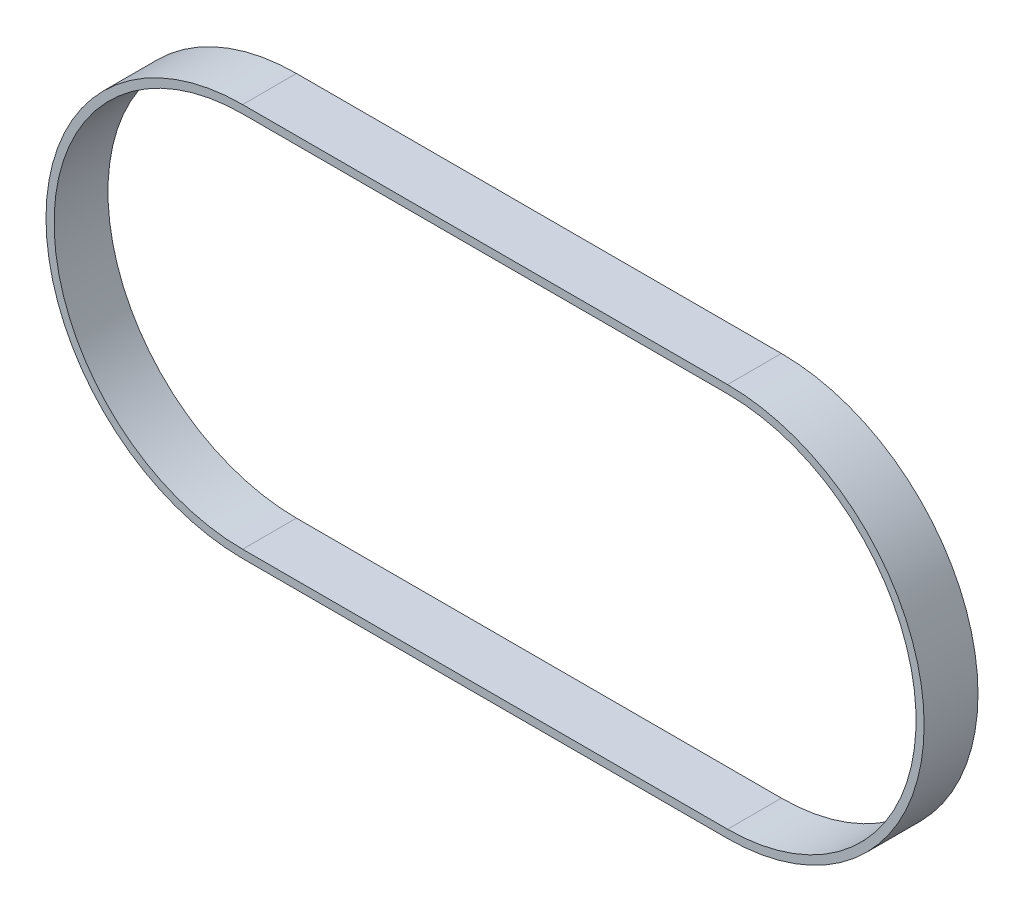
ISO-10303-21;
HEADER;
FILE_DESCRIPTION(('STEP AP214'),'2;1');
FILE_NAME('part.step','',(''),(''),'','','');
FILE_SCHEMA(('AUTOMOTIVE_DESIGN { 1 0 10303 214 1 1 1 1 }'));
ENDSEC;
DATA;
#1=APPLICATION_CONTEXT('core data for automotive mechanical design processes');
#2=APPLICATION_PROTOCOL_DEFINITION('international standard','automotive_design',2000,#1);
#3=PRODUCT_CONTEXT('',#1,'mechanical');
#4=PRODUCT('Part','Part','',(#3));
#5=PRODUCT_RELATED_PRODUCT_CATEGORY('part','',(#4));
#6=PRODUCT_DEFINITION_FORMATION('','',#4);
#7=PRODUCT_DEFINITION_CONTEXT('part definition',#1,'design');
#8=PRODUCT_DEFINITION('design','',#6,#7);
#9=PRODUCT_DEFINITION_SHAPE('','',#8);
#10=(LENGTH_UNIT() NAMED_UNIT(*) SI_UNIT(.MILLI.,.METRE.));
#11=(NAMED_UNIT(*) PLANE_ANGLE_UNIT() SI_UNIT($,.RADIAN.));
#12=(NAMED_UNIT(*) SI_UNIT($,.STERADIAN.) SOLID_ANGLE_UNIT());
#13=UNCERTAINTY_MEASURE_WITH_UNIT(LENGTH_MEASURE(1.E-05),#10,'distance_accuracy_value','');
#14=(GEOMETRIC_REPRESENTATION_CONTEXT(3) GLOBAL_UNCERTAINTY_ASSIGNED_CONTEXT((#13)) GLOBAL_UNIT_ASSIGNED_CONTEXT((#10,
#11,#12)) REPRESENTATION_CONTEXT('',''));
#15=CARTESIAN_POINT('',(0.,0.,0.));
#16=DIRECTION('',(0.,0.,1.));
#17=DIRECTION('',(1.,0.,0.));
#18=AXIS2_PLACEMENT_3D('',#15,#16,#17);
#19=CARTESIAN_POINT('',(-53.6850338233863,-5.94660194174758,10.));
#20=DIRECTION('',(0.,0.,1.));
#21=DIRECTION('',(1.,0.,0.));
#22=AXIS2_PLACEMENT_3D('',#19,#20,#21);
#23=PLANE('',#22);
#24=CARTESIAN_POINT('',(-53.6850338233863,-5.94660194174758,10.));
#25=DIRECTION('',(0.,0.,1.));
#26=DIRECTION('',(1.,0.,0.));
#27=AXIS2_PLACEMENT_3D('',#24,#25,#26);
#28=CIRCLE('',#27,36.5);
#29=CARTESIAN_POINT('',(-53.6850338233863,30.5533980582524,10.));
#30=VERTEX_POINT('',#29);
#31=CARTESIAN_POINT('',(-53.6850338233863,-42.4466019417476,10.));
#32=VERTEX_POINT('',#31);
#33=EDGE_CURVE('E153',#30,#32,#28,.T.);
#34=ORIENTED_EDGE('',*,*,#33,.T.);
#35=DIRECTION('',(1.,0.,0.));
#36=VECTOR('',#35,1.);
#37=CARTESIAN_POINT('',(-53.6850338233863,-42.4466019417476,10.));
#38=LINE('',#37,#36);
#39=CARTESIAN_POINT('',(36.3592233009709,-42.4466019417476,10.));
#40=VERTEX_POINT('',#39);
#41=EDGE_CURVE('E157',#32,#40,#38,.T.);
#42=ORIENTED_EDGE('',*,*,#41,.T.);
#43=CARTESIAN_POINT('',(36.3592233009709,-5.94660194174758,10.));
#44=DIRECTION('',(0.,0.,1.));
#45=DIRECTION('',(1.,0.,0.));
#46=AXIS2_PLACEMENT_3D('',#43,#44,#45);
#47=CIRCLE('',#46,36.5);
#48=CARTESIAN_POINT('',(36.3592233009709,30.5533980582524,10.));
#49=VERTEX_POINT('',#48);
#50=EDGE_CURVE('E161',#40,#49,#47,.T.);
#51=ORIENTED_EDGE('',*,*,#50,.T.);
#52=DIRECTION('',(-1.,0.,0.));
#53=VECTOR('',#52,1.);
#54=CARTESIAN_POINT('',(-53.6850338233863,30.5533980582524,10.));
#55=LINE('',#54,#53);
#56=EDGE_CURVE('E164',#49,#30,#55,.T.);
#57=ORIENTED_EDGE('',*,*,#56,.T.);
#58=EDGE_LOOP('',(#34,#42,#51,#57));
#59=FACE_BOUND('',#58,.T.);
#60=DIRECTION('',(1.,0.,0.));
#61=VECTOR('',#60,1.);
#62=CARTESIAN_POINT('',(-53.6850338233863,-40.9466019417476,10.));
#63=LINE('',#62,#61);
#64=CARTESIAN_POINT('',(-53.6850338233863,-40.9466019417476,10.));
#65=VERTEX_POINT('',#64);
#66=CARTESIAN_POINT('',(36.3592233009709,-40.9466019417476,10.));
#67=VERTEX_POINT('',#66);
#68=EDGE_CURVE('E114',#65,#67,#63,.T.);
#69=ORIENTED_EDGE('',*,*,#68,.F.);
#70=CARTESIAN_POINT('',(-53.6850338233863,-5.94660194174758,10.));
#71=DIRECTION('',(0.,0.,1.));
#72=DIRECTION('',(1.,0.,0.));
#73=AXIS2_PLACEMENT_3D('',#70,#71,#72);
#74=CIRCLE('',#73,35.);
#75=CARTESIAN_POINT('',(-53.6850338233863,29.0533980582524,10.));
#76=VERTEX_POINT('',#75);
#77=EDGE_CURVE('E105',#76,#65,#74,.T.);
#78=ORIENTED_EDGE('',*,*,#77,.F.);
#79=DIRECTION('',(-1.,0.,0.));
#80=VECTOR('',#79,1.);
#81=CARTESIAN_POINT('',(-53.6850338233863,29.0533980582524,10.));
#82=LINE('',#81,#80);
#83=CARTESIAN_POINT('',(36.3592233009709,29.0533980582524,10.));
#84=VERTEX_POINT('',#83);
#85=EDGE_CURVE('E131',#84,#76,#82,.T.);
#86=ORIENTED_EDGE('',*,*,#85,.F.);
#87=CARTESIAN_POINT('',(36.3592233009709,-5.94660194174758,10.));
#88=DIRECTION('',(0.,0.,1.));
#89=DIRECTION('',(1.,0.,0.));
#90=AXIS2_PLACEMENT_3D('',#87,#88,#89);
#91=CIRCLE('',#90,35.);
#92=EDGE_CURVE('E127',#67,#84,#91,.T.);
#93=ORIENTED_EDGE('',*,*,#92,.F.);
#94=EDGE_LOOP('',(#69,#78,#86,#93));
#95=FACE_BOUND('',#94,.T.);
#96=ADVANCED_FACE('F39',(#59,#95),#23,.T.);
#97=CARTESIAN_POINT('',(-53.6850338233863,-5.94660194174758,0.));
#98=DIRECTION('',(0.,0.,1.));
#99=DIRECTION('',(1.,0.,0.));
#100=AXIS2_PLACEMENT_3D('',#97,#98,#99);
#101=PLANE('',#100);
#102=CARTESIAN_POINT('',(-53.6850338233863,-5.94660194174758,0.));
#103=DIRECTION('',(0.,0.,1.));
#104=DIRECTION('',(1.,0.,0.));
#105=AXIS2_PLACEMENT_3D('',#102,#103,#104);
#106=CIRCLE('',#105,36.5);
#107=CARTESIAN_POINT('',(-53.6850338233863,30.5533980582524,0.));
#108=VERTEX_POINT('',#107);
#109=CARTESIAN_POINT('',(-53.6850338233863,-42.4466019417476,0.));
#110=VERTEX_POINT('',#109);
#111=EDGE_CURVE('E123',#108,#110,#106,.T.);
#112=ORIENTED_EDGE('',*,*,#111,.F.);
#113=DIRECTION('',(-1.,0.,0.));
#114=VECTOR('',#113,1.);
#115=CARTESIAN_POINT('',(-53.6850338233863,30.5533980582524,0.));
#116=LINE('',#115,#114);
#117=CARTESIAN_POINT('',(36.3592233009709,30.5533980582524,0.));
#118=VERTEX_POINT('',#117);
#119=EDGE_CURVE('E158',#118,#108,#116,.T.);
#120=ORIENTED_EDGE('',*,*,#119,.F.);
#121=CARTESIAN_POINT('',(36.3592233009709,-5.94660194174758,0.));
#122=DIRECTION('',(0.,0.,1.));
#123=DIRECTION('',(1.,0.,0.));
#124=AXIS2_PLACEMENT_3D('',#121,#122,#123);
#125=CIRCLE('',#124,36.5);
#126=CARTESIAN_POINT('',(36.3592233009709,-42.4466019417476,0.));
#127=VERTEX_POINT('',#126);
#128=EDGE_CURVE('E174',#127,#118,#125,.T.);
#129=ORIENTED_EDGE('',*,*,#128,.F.);
#130=DIRECTION('',(1.,0.,0.));
#131=VECTOR('',#130,1.);
#132=CARTESIAN_POINT('',(-53.6850338233863,-42.4466019417476,0.));
#133=LINE('',#132,#131);
#134=EDGE_CURVE('E171',#110,#127,#133,.T.);
#135=ORIENTED_EDGE('',*,*,#134,.F.);
#136=EDGE_LOOP('',(#112,#120,#129,#135));
#137=FACE_BOUND('',#136,.T.);
#138=CARTESIAN_POINT('',(-53.6850338233863,-5.94660194174758,0.));
#139=DIRECTION('',(0.,0.,1.));
#140=DIRECTION('',(1.,0.,0.));
#141=AXIS2_PLACEMENT_3D('',#138,#139,#140);
#142=CIRCLE('',#141,35.);
#143=CARTESIAN_POINT('',(-53.6850338233863,29.0533980582524,0.));
#144=VERTEX_POINT('',#143);
#145=CARTESIAN_POINT('',(-53.6850338233863,-40.9466019417476,0.));
#146=VERTEX_POINT('',#145);
#147=EDGE_CURVE('E63',#144,#146,#142,.T.);
#148=ORIENTED_EDGE('',*,*,#147,.T.);
#149=DIRECTION('',(1.,0.,0.));
#150=VECTOR('',#149,1.);
#151=CARTESIAN_POINT('',(-53.6850338233863,-40.9466019417476,0.));
#152=LINE('',#151,#150);
#153=CARTESIAN_POINT('',(36.3592233009709,-40.9466019417476,0.));
#154=VERTEX_POINT('',#153);
#155=EDGE_CURVE('E121',#146,#154,#152,.T.);
#156=ORIENTED_EDGE('',*,*,#155,.T.);
#157=CARTESIAN_POINT('',(36.3592233009709,-5.94660194174758,0.));
#158=DIRECTION('',(0.,0.,1.));
#159=DIRECTION('',(1.,0.,0.));
#160=AXIS2_PLACEMENT_3D('',#157,#158,#159);
#161=CIRCLE('',#160,35.);
#162=CARTESIAN_POINT('',(36.3592233009709,29.0533980582524,0.));
#163=VERTEX_POINT('',#162);
#164=EDGE_CURVE('E140',#154,#163,#161,.T.);
#165=ORIENTED_EDGE('',*,*,#164,.T.);
#166=DIRECTION('',(-1.,0.,0.));
#167=VECTOR('',#166,1.);
#168=CARTESIAN_POINT('',(-53.6850338233863,29.0533980582524,0.));
#169=LINE('',#168,#167);
#170=EDGE_CURVE('E115',#163,#144,#169,.T.);
#171=ORIENTED_EDGE('',*,*,#170,.T.);
#172=EDGE_LOOP('',(#148,#156,#165,#171));
#173=FACE_BOUND('',#172,.T.);
#174=ADVANCED_FACE('F197',(#137,#173),#101,.F.);
#175=CARTESIAN_POINT('',(-53.6850338233863,-5.94660194174758,10.));
#176=DIRECTION('',(0.,0.,-1.));
#177=DIRECTION('',(-1.,0.,0.));
#178=AXIS2_PLACEMENT_3D('',#175,#176,#177);
#179=CYLINDRICAL_SURFACE('',#178,36.5);
#180=ORIENTED_EDGE('',*,*,#111,.T.);
#181=DIRECTION('',(0.,0.,-1.));
#182=VECTOR('',#181,1.);
#183=CARTESIAN_POINT('',(-53.6850338233863,-42.4466019417476,10.));
#184=LINE('',#183,#182);
#185=EDGE_CURVE('E11',#32,#110,#184,.T.);
#186=ORIENTED_EDGE('',*,*,#185,.F.);
#187=ORIENTED_EDGE('',*,*,#33,.F.);
#188=DIRECTION('',(0.,0.,-1.));
#189=VECTOR('',#188,1.);
#190=CARTESIAN_POINT('',(-53.6850338233863,30.5533980582524,10.));
#191=LINE('',#190,#189);
#192=EDGE_CURVE('E167',#30,#108,#191,.T.);
#193=ORIENTED_EDGE('',*,*,#192,.T.);
#194=EDGE_LOOP('',(#180,#186,#187,#193));
#195=FACE_BOUND('',#194,.T.);
#196=ADVANCED_FACE('F41',(#195),#179,.T.);
#197=CARTESIAN_POINT('',(-53.6850338233863,-42.4466019417476,10.));
#198=DIRECTION('',(0.,1.,0.));
#199=DIRECTION('',(0.,0.,1.));
#200=AXIS2_PLACEMENT_3D('',#197,#198,#199);
#201=PLANE('',#200);
#202=ORIENTED_EDGE('',*,*,#134,.T.);
#203=DIRECTION('',(0.,0.,-1.));
#204=VECTOR('',#203,1.);
#205=CARTESIAN_POINT('',(36.3592233009709,-42.4466019417476,10.));
#206=LINE('',#205,#204);
#207=EDGE_CURVE('E48',#40,#127,#206,.T.);
#208=ORIENTED_EDGE('',*,*,#207,.F.);
#209=ORIENTED_EDGE('',*,*,#41,.F.);
#210=ORIENTED_EDGE('',*,*,#185,.T.);
#211=EDGE_LOOP('',(#202,#208,#209,#210));
#212=FACE_BOUND('',#211,.T.);
#213=ADVANCED_FACE('F207',(#212),#201,.F.);
#214=CARTESIAN_POINT('',(36.3592233009709,-5.94660194174758,10.));
#215=DIRECTION('',(0.,0.,-1.));
#216=DIRECTION('',(-1.,0.,0.));
#217=AXIS2_PLACEMENT_3D('',#214,#215,#216);
#218=CYLINDRICAL_SURFACE('',#217,36.5);
#219=ORIENTED_EDGE('',*,*,#128,.T.);
#220=DIRECTION('',(0.,0.,-1.));
#221=VECTOR('',#220,1.);
#222=CARTESIAN_POINT('',(36.3592233009709,30.5533980582524,10.));
#223=LINE('',#222,#221);
#224=EDGE_CURVE('E182',#49,#118,#223,.T.);
#225=ORIENTED_EDGE('',*,*,#224,.F.);
#226=ORIENTED_EDGE('',*,*,#50,.F.);
#227=ORIENTED_EDGE('',*,*,#207,.T.);
#228=EDGE_LOOP('',(#219,#225,#226,#227));
#229=FACE_BOUND('',#228,.T.);
#230=ADVANCED_FACE('F191',(#229),#218,.T.);
#231=CARTESIAN_POINT('',(-53.6850338233863,30.5533980582524,10.));
#232=DIRECTION('',(0.,-1.,0.));
#233=DIRECTION('',(0.,0.,-1.));
#234=AXIS2_PLACEMENT_3D('',#231,#232,#233);
#235=PLANE('',#234);
#236=ORIENTED_EDGE('',*,*,#119,.T.);
#237=ORIENTED_EDGE('',*,*,#192,.F.);
#238=ORIENTED_EDGE('',*,*,#56,.F.);
#239=ORIENTED_EDGE('',*,*,#224,.T.);
#240=EDGE_LOOP('',(#236,#237,#238,#239));
#241=FACE_BOUND('',#240,.T.);
#242=ADVANCED_FACE('F201',(#241),#235,.F.);
#243=CARTESIAN_POINT('',(-53.6850338233863,-5.94660194174758,10.));
#244=DIRECTION('',(0.,0.,-1.));
#245=DIRECTION('',(-1.,0.,0.));
#246=AXIS2_PLACEMENT_3D('',#243,#244,#245);
#247=CYLINDRICAL_SURFACE('',#246,35.);
#248=ORIENTED_EDGE('',*,*,#147,.F.);
#249=DIRECTION('',(0.,0.,-1.));
#250=VECTOR('',#249,1.);
#251=CARTESIAN_POINT('',(-53.6850338233863,29.0533980582524,10.));
#252=LINE('',#251,#250);
#253=EDGE_CURVE('E109',#76,#144,#252,.T.);
#254=ORIENTED_EDGE('',*,*,#253,.F.);
#255=ORIENTED_EDGE('',*,*,#77,.T.);
#256=DIRECTION('',(0.,0.,-1.));
#257=VECTOR('',#256,1.);
#258=CARTESIAN_POINT('',(-53.6850338233863,-40.9466019417476,10.));
#259=LINE('',#258,#257);
#260=EDGE_CURVE('E108',#65,#146,#259,.T.);
#261=ORIENTED_EDGE('',*,*,#260,.T.);
#262=EDGE_LOOP('',(#248,#254,#255,#261));
#263=FACE_BOUND('',#262,.T.);
#264=ADVANCED_FACE('F107',(#263),#247,.F.);
#265=CARTESIAN_POINT('',(-53.6850338233863,-40.9466019417476,10.));
#266=DIRECTION('',(0.,1.,0.));
#267=DIRECTION('',(0.,0.,1.));
#268=AXIS2_PLACEMENT_3D('',#265,#266,#267);
#269=PLANE('',#268);
#270=ORIENTED_EDGE('',*,*,#155,.F.);
#271=ORIENTED_EDGE('',*,*,#260,.F.);
#272=ORIENTED_EDGE('',*,*,#68,.T.);
#273=DIRECTION('',(0.,0.,-1.));
#274=VECTOR('',#273,1.);
#275=CARTESIAN_POINT('',(36.3592233009709,-40.9466019417476,10.));
#276=LINE('',#275,#274);
#277=EDGE_CURVE('E124',#67,#154,#276,.T.);
#278=ORIENTED_EDGE('',*,*,#277,.T.);
#279=EDGE_LOOP('',(#270,#271,#272,#278));
#280=FACE_BOUND('',#279,.T.);
#281=ADVANCED_FACE('F118',(#280),#269,.T.);
#282=CARTESIAN_POINT('',(36.3592233009709,-5.94660194174758,10.));
#283=DIRECTION('',(0.,0.,-1.));
#284=DIRECTION('',(-1.,0.,0.));
#285=AXIS2_PLACEMENT_3D('',#282,#283,#284);
#286=CYLINDRICAL_SURFACE('',#285,35.);
#287=ORIENTED_EDGE('',*,*,#164,.F.);
#288=ORIENTED_EDGE('',*,*,#277,.F.);
#289=ORIENTED_EDGE('',*,*,#92,.T.);
#290=DIRECTION('',(0.,0.,-1.));
#291=VECTOR('',#290,1.);
#292=CARTESIAN_POINT('',(36.3592233009709,29.0533980582524,10.));
#293=LINE('',#292,#291);
#294=EDGE_CURVE('E55',#84,#163,#293,.T.);
#295=ORIENTED_EDGE('',*,*,#294,.T.);
#296=EDGE_LOOP('',(#287,#288,#289,#295));
#297=FACE_BOUND('',#296,.T.);
#298=ADVANCED_FACE('F230',(#297),#286,.F.);
#299=CARTESIAN_POINT('',(-53.6850338233863,29.0533980582524,10.));
#300=DIRECTION('',(0.,-1.,0.));
#301=DIRECTION('',(0.,0.,-1.));
#302=AXIS2_PLACEMENT_3D('',#299,#300,#301);
#303=PLANE('',#302);
#304=ORIENTED_EDGE('',*,*,#170,.F.);
#305=ORIENTED_EDGE('',*,*,#294,.F.);
#306=ORIENTED_EDGE('',*,*,#85,.T.);
#307=ORIENTED_EDGE('',*,*,#253,.T.);
#308=EDGE_LOOP('',(#304,#305,#306,#307));
#309=FACE_BOUND('',#308,.T.);
#310=ADVANCED_FACE('F234',(#309),#303,.T.);
#311=CLOSED_SHELL('',(#96,#174,#196,#213,#230,#242,#264,#281,#298,#310));
#312=MANIFOLD_SOLID_BREP('B2',#311);
#313=ADVANCED_BREP_SHAPE_REPRESENTATION('',(#18,#312),#14);
#314=SHAPE_DEFINITION_REPRESENTATION(#9,#313);
ENDSEC;
END-ISO-10303-21;
